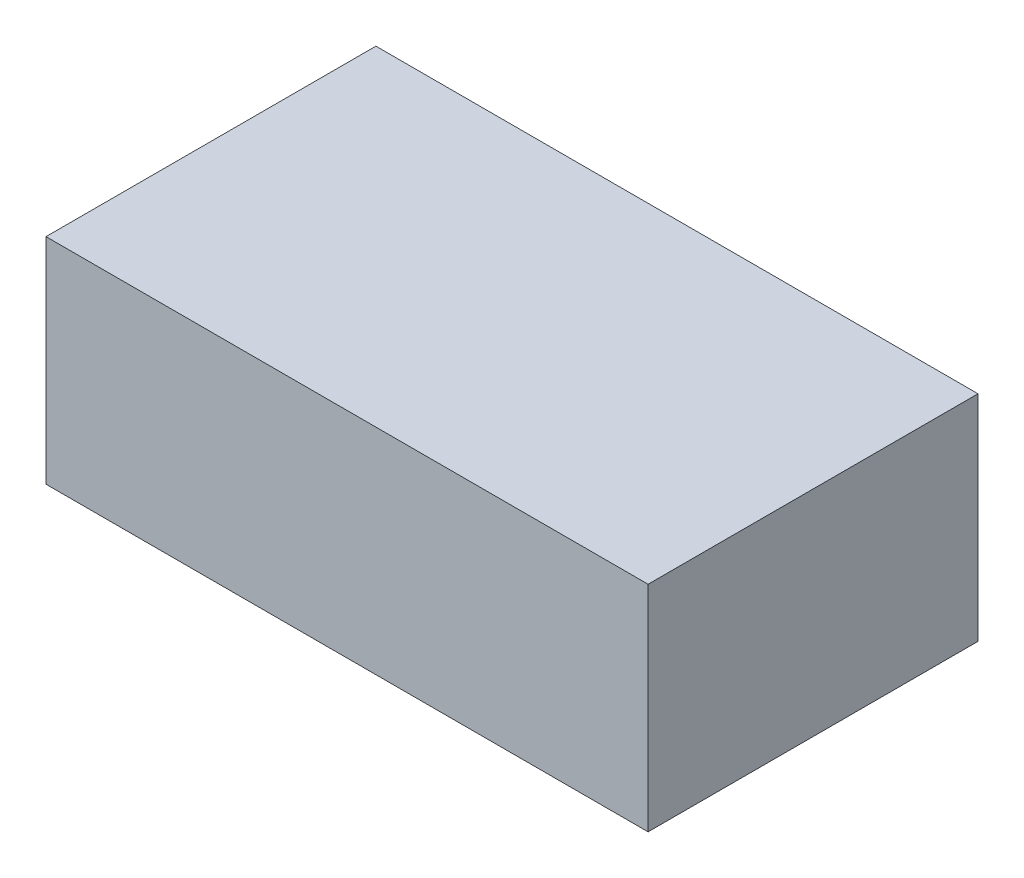
ISO-10303-21;
HEADER;
FILE_DESCRIPTION(('STEP AP214'),'2;1');
FILE_NAME('part.step','',(''),(''),'','','');
FILE_SCHEMA(('AUTOMOTIVE_DESIGN { 1 0 10303 214 1 1 1 1 }'));
ENDSEC;
DATA;
#1=APPLICATION_CONTEXT('core data for automotive mechanical design processes');
#2=APPLICATION_PROTOCOL_DEFINITION('international standard','automotive_design',2000,#1);
#3=PRODUCT_CONTEXT('',#1,'mechanical');
#4=PRODUCT('Part','Part','',(#3));
#5=PRODUCT_RELATED_PRODUCT_CATEGORY('part','',(#4));
#6=PRODUCT_DEFINITION_FORMATION('','',#4);
#7=PRODUCT_DEFINITION_CONTEXT('part definition',#1,'design');
#8=PRODUCT_DEFINITION('design','',#6,#7);
#9=PRODUCT_DEFINITION_SHAPE('','',#8);
#10=(LENGTH_UNIT() NAMED_UNIT(*) SI_UNIT(.MILLI.,.METRE.));
#11=(NAMED_UNIT(*) PLANE_ANGLE_UNIT() SI_UNIT($,.RADIAN.));
#12=(NAMED_UNIT(*) SI_UNIT($,.STERADIAN.) SOLID_ANGLE_UNIT());
#13=UNCERTAINTY_MEASURE_WITH_UNIT(LENGTH_MEASURE(1.E-05),#10,'distance_accuracy_value','');
#14=(GEOMETRIC_REPRESENTATION_CONTEXT(3) GLOBAL_UNCERTAINTY_ASSIGNED_CONTEXT((#13)) GLOBAL_UNIT_ASSIGNED_CONTEXT((#10,
#11,#12)) REPRESENTATION_CONTEXT('',''));
#15=CARTESIAN_POINT('',(0.,0.,0.));
#16=DIRECTION('',(0.,0.,1.));
#17=DIRECTION('',(1.,0.,0.));
#18=AXIS2_PLACEMENT_3D('',#15,#16,#17);
#19=CARTESIAN_POINT('',(0.,0.13,0.));
#20=DIRECTION('',(0.,1.,0.));
#21=DIRECTION('',(0.,0.,1.));
#22=AXIS2_PLACEMENT_3D('',#19,#20,#21);
#23=PLANE('',#22);
#24=DIRECTION('',(0.,0.,1.));
#25=VECTOR('',#24,1.);
#26=CARTESIAN_POINT('',(-0.1825,0.13,0.));
#27=LINE('',#26,#25);
#28=CARTESIAN_POINT('',(-0.1825,0.13,-0.1));
#29=VERTEX_POINT('',#28);
#30=CARTESIAN_POINT('',(-0.1825,0.13,0.1));
#31=VERTEX_POINT('',#30);
#32=EDGE_CURVE('E11',#29,#31,#27,.T.);
#33=ORIENTED_EDGE('',*,*,#32,.T.);
#34=DIRECTION('',(1.,0.,0.));
#35=VECTOR('',#34,1.);
#36=CARTESIAN_POINT('',(0.,0.13,0.1));
#37=LINE('',#36,#35);
#38=CARTESIAN_POINT('',(0.1825,0.13,0.1));
#39=VERTEX_POINT('',#38);
#40=EDGE_CURVE('E25',#31,#39,#37,.T.);
#41=ORIENTED_EDGE('',*,*,#40,.T.);
#42=DIRECTION('',(0.,0.,-1.));
#43=VECTOR('',#42,1.);
#44=CARTESIAN_POINT('',(0.1825,0.13,0.));
#45=LINE('',#44,#43);
#46=CARTESIAN_POINT('',(0.1825,0.13,-0.1));
#47=VERTEX_POINT('',#46);
#48=EDGE_CURVE('E69',#39,#47,#45,.T.);
#49=ORIENTED_EDGE('',*,*,#48,.T.);
#50=DIRECTION('',(-1.,0.,0.));
#51=VECTOR('',#50,1.);
#52=CARTESIAN_POINT('',(0.,0.13,-0.1));
#53=LINE('',#52,#51);
#54=EDGE_CURVE('E92',#47,#29,#53,.T.);
#55=ORIENTED_EDGE('',*,*,#54,.T.);
#56=EDGE_LOOP('',(#33,#41,#49,#55));
#57=FACE_BOUND('',#56,.T.);
#58=ADVANCED_FACE('F17',(#57),#23,.T.);
#59=CARTESIAN_POINT('',(-0.1825,0.13,-0.1));
#60=DIRECTION('',(0.,0.,1.));
#61=DIRECTION('',(1.,0.,0.));
#62=AXIS2_PLACEMENT_3D('',#59,#60,#61);
#63=PLANE('',#62);
#64=DIRECTION('',(0.,1.,0.));
#65=VECTOR('',#64,1.);
#66=CARTESIAN_POINT('',(-0.1825,0.13,-0.1));
#67=LINE('',#66,#65);
#68=CARTESIAN_POINT('',(-0.1825,0.,-0.1));
#69=VERTEX_POINT('',#68);
#70=EDGE_CURVE('E87',#69,#29,#67,.T.);
#71=ORIENTED_EDGE('',*,*,#70,.T.);
#72=ORIENTED_EDGE('',*,*,#54,.F.);
#73=DIRECTION('',(0.,1.,0.));
#74=VECTOR('',#73,1.);
#75=CARTESIAN_POINT('',(0.1825,0.13,-0.1));
#76=LINE('',#75,#74);
#77=CARTESIAN_POINT('',(0.1825,0.,-0.1));
#78=VERTEX_POINT('',#77);
#79=EDGE_CURVE('E76',#78,#47,#76,.T.);
#80=ORIENTED_EDGE('',*,*,#79,.F.);
#81=DIRECTION('',(1.,0.,0.));
#82=VECTOR('',#81,1.);
#83=CARTESIAN_POINT('',(-0.1825,0.,-0.1));
#84=LINE('',#83,#82);
#85=EDGE_CURVE('E61',#69,#78,#84,.T.);
#86=ORIENTED_EDGE('',*,*,#85,.F.);
#87=EDGE_LOOP('',(#71,#72,#80,#86));
#88=FACE_BOUND('',#87,.T.);
#89=ADVANCED_FACE('F105',(#88),#63,.F.);
#90=CARTESIAN_POINT('',(0.,0.,0.));
#91=DIRECTION('',(0.,1.,0.));
#92=DIRECTION('',(0.,0.,1.));
#93=AXIS2_PLACEMENT_3D('',#90,#91,#92);
#94=PLANE('',#93);
#95=DIRECTION('',(-1.,0.,0.));
#96=VECTOR('',#95,1.);
#97=CARTESIAN_POINT('',(-0.1825,0.,0.1));
#98=LINE('',#97,#96);
#99=CARTESIAN_POINT('',(0.1825,0.,0.1));
#100=VERTEX_POINT('',#99);
#101=CARTESIAN_POINT('',(-0.1825,0.,0.1));
#102=VERTEX_POINT('',#101);
#103=EDGE_CURVE('E59',#100,#102,#98,.T.);
#104=ORIENTED_EDGE('',*,*,#103,.T.);
#105=DIRECTION('',(0.,0.,-1.));
#106=VECTOR('',#105,1.);
#107=CARTESIAN_POINT('',(-0.1825,0.,-0.1));
#108=LINE('',#107,#106);
#109=EDGE_CURVE('E64',#102,#69,#108,.T.);
#110=ORIENTED_EDGE('',*,*,#109,.T.);
#111=ORIENTED_EDGE('',*,*,#85,.T.);
#112=DIRECTION('',(0.,0.,1.));
#113=VECTOR('',#112,1.);
#114=CARTESIAN_POINT('',(0.1825,0.,-0.1));
#115=LINE('',#114,#113);
#116=EDGE_CURVE('E54',#78,#100,#115,.T.);
#117=ORIENTED_EDGE('',*,*,#116,.T.);
#118=EDGE_LOOP('',(#104,#110,#111,#117));
#119=FACE_BOUND('',#118,.T.);
#120=ADVANCED_FACE('F56',(#119),#94,.F.);
#121=CARTESIAN_POINT('',(0.1825,0.13,-0.1));
#122=DIRECTION('',(-1.,0.,0.));
#123=DIRECTION('',(0.,0.,1.));
#124=AXIS2_PLACEMENT_3D('',#121,#122,#123);
#125=PLANE('',#124);
#126=ORIENTED_EDGE('',*,*,#79,.T.);
#127=ORIENTED_EDGE('',*,*,#48,.F.);
#128=DIRECTION('',(0.,-1.,0.));
#129=VECTOR('',#128,1.);
#130=CARTESIAN_POINT('',(0.1825,0.13,0.1));
#131=LINE('',#130,#129);
#132=EDGE_CURVE('E65',#39,#100,#131,.T.);
#133=ORIENTED_EDGE('',*,*,#132,.T.);
#134=ORIENTED_EDGE('',*,*,#116,.F.);
#135=EDGE_LOOP('',(#126,#127,#133,#134));
#136=FACE_BOUND('',#135,.T.);
#137=ADVANCED_FACE('F68',(#136),#125,.F.);
#138=CARTESIAN_POINT('',(-0.1825,0.13,0.1));
#139=DIRECTION('',(0.,0.,-1.));
#140=DIRECTION('',(-1.,0.,0.));
#141=AXIS2_PLACEMENT_3D('',#138,#139,#140);
#142=PLANE('',#141);
#143=ORIENTED_EDGE('',*,*,#132,.F.);
#144=ORIENTED_EDGE('',*,*,#40,.F.);
#145=DIRECTION('',(0.,1.,0.));
#146=VECTOR('',#145,1.);
#147=CARTESIAN_POINT('',(-0.1825,0.13,0.1));
#148=LINE('',#147,#146);
#149=EDGE_CURVE('E71',#102,#31,#148,.T.);
#150=ORIENTED_EDGE('',*,*,#149,.F.);
#151=ORIENTED_EDGE('',*,*,#103,.F.);
#152=EDGE_LOOP('',(#143,#144,#150,#151));
#153=FACE_BOUND('',#152,.T.);
#154=ADVANCED_FACE('F73',(#153),#142,.F.);
#155=CARTESIAN_POINT('',(-0.1825,0.13,-0.1));
#156=DIRECTION('',(1.,0.,0.));
#157=DIRECTION('',(0.,0.,-1.));
#158=AXIS2_PLACEMENT_3D('',#155,#156,#157);
#159=PLANE('',#158);
#160=ORIENTED_EDGE('',*,*,#149,.T.);
#161=ORIENTED_EDGE('',*,*,#32,.F.);
#162=ORIENTED_EDGE('',*,*,#70,.F.);
#163=ORIENTED_EDGE('',*,*,#109,.F.);
#164=EDGE_LOOP('',(#160,#161,#162,#163));
#165=FACE_BOUND('',#164,.T.);
#166=ADVANCED_FACE('F108',(#165),#159,.F.);
#167=CLOSED_SHELL('',(#58,#89,#120,#137,#154,#166));
#168=MANIFOLD_SOLID_BREP('B1',#167);
#169=ADVANCED_BREP_SHAPE_REPRESENTATION('',(#18,#168),#14);
#170=SHAPE_DEFINITION_REPRESENTATION(#9,#169);
ENDSEC;
END-ISO-10303-21;
